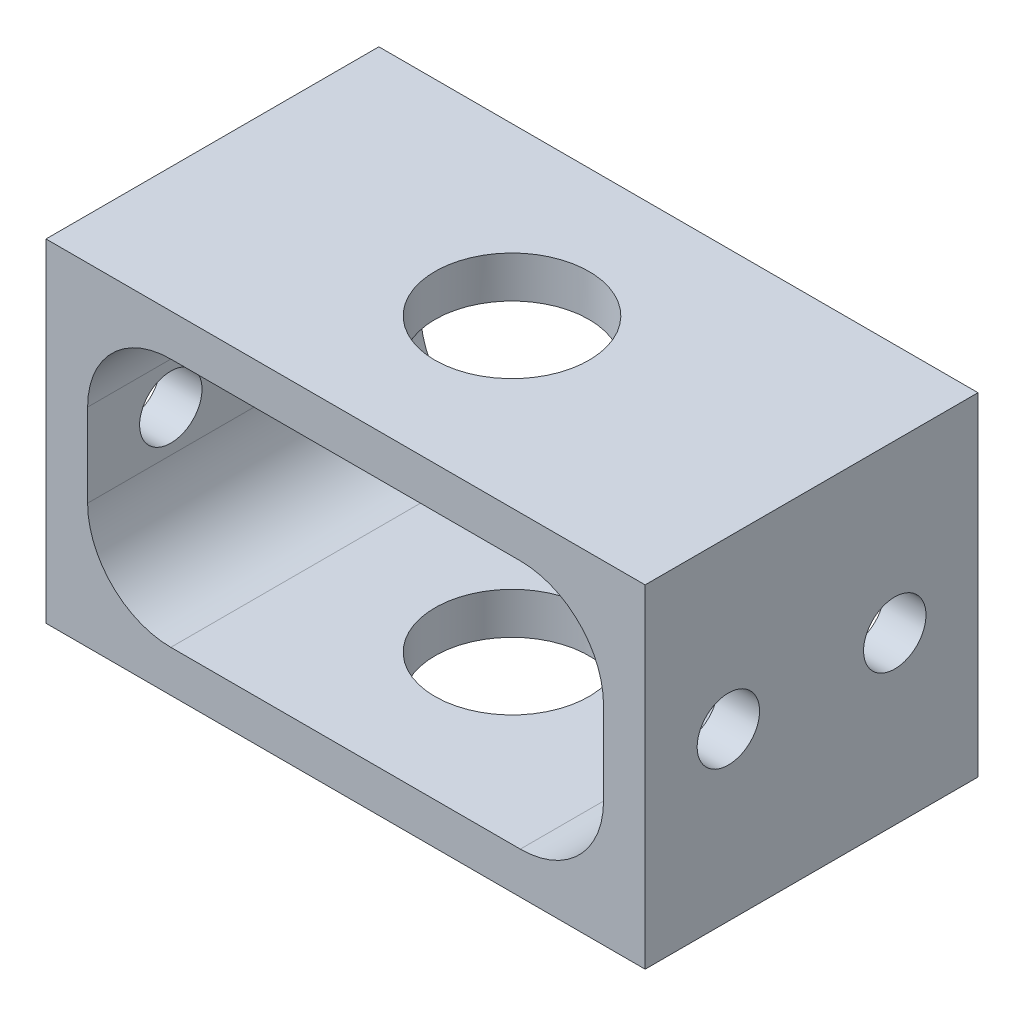
ISO-10303-21;
HEADER;
FILE_DESCRIPTION(('STEP AP214'),'2;1');
FILE_NAME('part.step','',(''),(''),'','','');
FILE_SCHEMA(('AUTOMOTIVE_DESIGN { 1 0 10303 214 1 1 1 1 }'));
ENDSEC;
DATA;
#1=APPLICATION_CONTEXT('core data for automotive mechanical design processes');
#2=APPLICATION_PROTOCOL_DEFINITION('international standard','automotive_design',2000,#1);
#3=PRODUCT_CONTEXT('',#1,'mechanical');
#4=PRODUCT('Part','Part','',(#3));
#5=PRODUCT_RELATED_PRODUCT_CATEGORY('part','',(#4));
#6=PRODUCT_DEFINITION_FORMATION('','',#4);
#7=PRODUCT_DEFINITION_CONTEXT('part definition',#1,'design');
#8=PRODUCT_DEFINITION('design','',#6,#7);
#9=PRODUCT_DEFINITION_SHAPE('','',#8);
#10=(LENGTH_UNIT() NAMED_UNIT(*) SI_UNIT(.MILLI.,.METRE.));
#11=(NAMED_UNIT(*) PLANE_ANGLE_UNIT() SI_UNIT($,.RADIAN.));
#12=(NAMED_UNIT(*) SI_UNIT($,.STERADIAN.) SOLID_ANGLE_UNIT());
#13=UNCERTAINTY_MEASURE_WITH_UNIT(LENGTH_MEASURE(1.E-05),#10,'distance_accuracy_value','');
#14=(GEOMETRIC_REPRESENTATION_CONTEXT(3) GLOBAL_UNCERTAINTY_ASSIGNED_CONTEXT((#13)) GLOBAL_UNIT_ASSIGNED_CONTEXT((#10,
#11,#12)) REPRESENTATION_CONTEXT('',''));
#15=CARTESIAN_POINT('',(0.,0.,0.));
#16=DIRECTION('',(0.,0.,1.));
#17=DIRECTION('',(1.,0.,0.));
#18=AXIS2_PLACEMENT_3D('',#15,#16,#17);
#19=CARTESIAN_POINT('',(0.,0.,16.));
#20=DIRECTION('',(0.,0.,-1.));
#21=DIRECTION('',(-1.,0.,0.));
#22=AXIS2_PLACEMENT_3D('',#19,#20,#21);
#23=PLANE('',#22);
#24=DIRECTION('',(-1.,0.,0.));
#25=VECTOR('',#24,1.);
#26=CARTESIAN_POINT('',(-14.4,8.,16.));
#27=LINE('',#26,#25);
#28=CARTESIAN_POINT('',(14.4,8.,16.));
#29=VERTEX_POINT('',#28);
#30=CARTESIAN_POINT('',(-14.4,8.,16.));
#31=VERTEX_POINT('',#30);
#32=EDGE_CURVE('E144',#29,#31,#27,.T.);
#33=ORIENTED_EDGE('',*,*,#32,.T.);
#34=DIRECTION('',(0.,-1.,0.));
#35=VECTOR('',#34,1.);
#36=CARTESIAN_POINT('',(-14.4,8.,16.));
#37=LINE('',#36,#35);
#38=CARTESIAN_POINT('',(-14.4,-8.,16.));
#39=VERTEX_POINT('',#38);
#40=EDGE_CURVE('E132',#31,#39,#37,.T.);
#41=ORIENTED_EDGE('',*,*,#40,.T.);
#42=DIRECTION('',(1.,0.,0.));
#43=VECTOR('',#42,1.);
#44=CARTESIAN_POINT('',(-14.4,-8.,16.));
#45=LINE('',#44,#43);
#46=CARTESIAN_POINT('',(14.4,-8.,16.));
#47=VERTEX_POINT('',#46);
#48=EDGE_CURVE('E143',#39,#47,#45,.T.);
#49=ORIENTED_EDGE('',*,*,#48,.T.);
#50=DIRECTION('',(0.,1.,0.));
#51=VECTOR('',#50,1.);
#52=CARTESIAN_POINT('',(14.4,8.,16.));
#53=LINE('',#52,#51);
#54=EDGE_CURVE('E148',#47,#29,#53,.T.);
#55=ORIENTED_EDGE('',*,*,#54,.T.);
#56=EDGE_LOOP('',(#33,#41,#49,#55));
#57=FACE_BOUND('',#56,.T.);
#58=DIRECTION('',(0.,1.,0.));
#59=VECTOR('',#58,1.);
#60=CARTESIAN_POINT('',(12.4,6.,16.));
#61=LINE('',#60,#59);
#62=CARTESIAN_POINT('',(12.4,-2.,16.));
#63=VERTEX_POINT('',#62);
#64=CARTESIAN_POINT('',(12.4,2.,16.));
#65=VERTEX_POINT('',#64);
#66=EDGE_CURVE('E238',#63,#65,#61,.T.);
#67=ORIENTED_EDGE('',*,*,#66,.F.);
#68=CARTESIAN_POINT('',(8.4,-2.,16.));
#69=DIRECTION('',(0.,0.,-1.));
#70=DIRECTION('',(-1.,0.,0.));
#71=AXIS2_PLACEMENT_3D('',#68,#69,#70);
#72=CIRCLE('',#71,4.);
#73=CARTESIAN_POINT('',(8.4,-6.,16.));
#74=VERTEX_POINT('',#73);
#75=EDGE_CURVE('E57',#63,#74,#72,.T.);
#76=ORIENTED_EDGE('',*,*,#75,.T.);
#77=DIRECTION('',(1.,0.,0.));
#78=VECTOR('',#77,1.);
#79=CARTESIAN_POINT('',(-12.4,-6.,16.));
#80=LINE('',#79,#78);
#81=CARTESIAN_POINT('',(-8.4,-6.,16.));
#82=VERTEX_POINT('',#81);
#83=EDGE_CURVE('E245',#82,#74,#80,.T.);
#84=ORIENTED_EDGE('',*,*,#83,.F.);
#85=CARTESIAN_POINT('',(-8.4,-2.,16.));
#86=DIRECTION('',(0.,0.,-1.));
#87=DIRECTION('',(-1.,0.,0.));
#88=AXIS2_PLACEMENT_3D('',#85,#86,#87);
#89=CIRCLE('',#88,4.);
#90=CARTESIAN_POINT('',(-12.4,-2.,16.));
#91=VERTEX_POINT('',#90);
#92=EDGE_CURVE('E11',#82,#91,#89,.T.);
#93=ORIENTED_EDGE('',*,*,#92,.T.);
#94=DIRECTION('',(0.,-1.,0.));
#95=VECTOR('',#94,1.);
#96=CARTESIAN_POINT('',(-12.4,6.,16.));
#97=LINE('',#96,#95);
#98=CARTESIAN_POINT('',(-12.4,2.,16.));
#99=VERTEX_POINT('',#98);
#100=EDGE_CURVE('E243',#99,#91,#97,.T.);
#101=ORIENTED_EDGE('',*,*,#100,.F.);
#102=CARTESIAN_POINT('',(-8.4,2.,16.));
#103=DIRECTION('',(0.,0.,-1.));
#104=DIRECTION('',(-1.,0.,0.));
#105=AXIS2_PLACEMENT_3D('',#102,#103,#104);
#106=CIRCLE('',#105,4.);
#107=CARTESIAN_POINT('',(-8.4,6.,16.));
#108=VERTEX_POINT('',#107);
#109=EDGE_CURVE('E218',#99,#108,#106,.T.);
#110=ORIENTED_EDGE('',*,*,#109,.T.);
#111=DIRECTION('',(-1.,0.,0.));
#112=VECTOR('',#111,1.);
#113=CARTESIAN_POINT('',(-12.4,6.,16.));
#114=LINE('',#113,#112);
#115=CARTESIAN_POINT('',(8.39999999999999,6.,16.));
#116=VERTEX_POINT('',#115);
#117=EDGE_CURVE('E250',#116,#108,#114,.T.);
#118=ORIENTED_EDGE('',*,*,#117,.F.);
#119=CARTESIAN_POINT('',(8.4,2.,16.));
#120=DIRECTION('',(0.,0.,-1.));
#121=DIRECTION('',(-1.,0.,0.));
#122=AXIS2_PLACEMENT_3D('',#119,#120,#121);
#123=CIRCLE('',#122,4.);
#124=EDGE_CURVE('E212',#116,#65,#123,.T.);
#125=ORIENTED_EDGE('',*,*,#124,.T.);
#126=EDGE_LOOP('',(#67,#76,#84,#93,#101,#110,#118,#125));
#127=FACE_BOUND('',#126,.T.);
#128=ADVANCED_FACE('F41',(#57,#127),#23,.F.);
#129=CARTESIAN_POINT('',(0.,0.,0.));
#130=DIRECTION('',(0.,0.,-1.));
#131=DIRECTION('',(-1.,0.,0.));
#132=AXIS2_PLACEMENT_3D('',#129,#130,#131);
#133=PLANE('',#132);
#134=DIRECTION('',(-1.,0.,0.));
#135=VECTOR('',#134,1.);
#136=CARTESIAN_POINT('',(-14.4,8.,0.));
#137=LINE('',#136,#135);
#138=CARTESIAN_POINT('',(14.4,8.,0.));
#139=VERTEX_POINT('',#138);
#140=CARTESIAN_POINT('',(-14.4,8.,0.));
#141=VERTEX_POINT('',#140);
#142=EDGE_CURVE('E157',#139,#141,#137,.T.);
#143=ORIENTED_EDGE('',*,*,#142,.F.);
#144=DIRECTION('',(0.,1.,0.));
#145=VECTOR('',#144,1.);
#146=CARTESIAN_POINT('',(14.4,8.,0.));
#147=LINE('',#146,#145);
#148=CARTESIAN_POINT('',(14.4,-8.,0.));
#149=VERTEX_POINT('',#148);
#150=EDGE_CURVE('E153',#149,#139,#147,.T.);
#151=ORIENTED_EDGE('',*,*,#150,.F.);
#152=DIRECTION('',(1.,0.,0.));
#153=VECTOR('',#152,1.);
#154=CARTESIAN_POINT('',(-14.4,-8.,0.));
#155=LINE('',#154,#153);
#156=CARTESIAN_POINT('',(-14.4,-8.,0.));
#157=VERTEX_POINT('',#156);
#158=EDGE_CURVE('E279',#157,#149,#155,.T.);
#159=ORIENTED_EDGE('',*,*,#158,.F.);
#160=DIRECTION('',(0.,-1.,0.));
#161=VECTOR('',#160,1.);
#162=CARTESIAN_POINT('',(-14.4,8.,0.));
#163=LINE('',#162,#161);
#164=EDGE_CURVE('E276',#141,#157,#163,.T.);
#165=ORIENTED_EDGE('',*,*,#164,.F.);
#166=EDGE_LOOP('',(#143,#151,#159,#165));
#167=FACE_BOUND('',#166,.T.);
#168=DIRECTION('',(0.,-1.,0.));
#169=VECTOR('',#168,1.);
#170=CARTESIAN_POINT('',(-12.4,6.,0.));
#171=LINE('',#170,#169);
#172=CARTESIAN_POINT('',(-12.4,2.,0.));
#173=VERTEX_POINT('',#172);
#174=CARTESIAN_POINT('',(-12.4,-2.,0.));
#175=VERTEX_POINT('',#174);
#176=EDGE_CURVE('E232',#173,#175,#171,.T.);
#177=ORIENTED_EDGE('',*,*,#176,.T.);
#178=CARTESIAN_POINT('',(-8.4,-2.,0.));
#179=DIRECTION('',(0.,0.,-1.));
#180=DIRECTION('',(-1.,0.,0.));
#181=AXIS2_PLACEMENT_3D('',#178,#179,#180);
#182=CIRCLE('',#181,4.);
#183=CARTESIAN_POINT('',(-8.4,-6.,0.));
#184=VERTEX_POINT('',#183);
#185=EDGE_CURVE('E50',#175,#184,#182,.F.);
#186=ORIENTED_EDGE('',*,*,#185,.T.);
#187=DIRECTION('',(1.,0.,0.));
#188=VECTOR('',#187,1.);
#189=CARTESIAN_POINT('',(-12.4,-6.,0.));
#190=LINE('',#189,#188);
#191=CARTESIAN_POINT('',(8.4,-6.,0.));
#192=VERTEX_POINT('',#191);
#193=EDGE_CURVE('E230',#184,#192,#190,.T.);
#194=ORIENTED_EDGE('',*,*,#193,.T.);
#195=CARTESIAN_POINT('',(8.4,-2.,0.));
#196=DIRECTION('',(0.,0.,-1.));
#197=DIRECTION('',(-1.,0.,0.));
#198=AXIS2_PLACEMENT_3D('',#195,#196,#197);
#199=CIRCLE('',#198,4.);
#200=CARTESIAN_POINT('',(12.4,-2.,0.));
#201=VERTEX_POINT('',#200);
#202=EDGE_CURVE('E221',#192,#201,#199,.F.);
#203=ORIENTED_EDGE('',*,*,#202,.T.);
#204=DIRECTION('',(0.,1.,0.));
#205=VECTOR('',#204,1.);
#206=CARTESIAN_POINT('',(12.4,6.,0.));
#207=LINE('',#206,#205);
#208=CARTESIAN_POINT('',(12.4,2.,0.));
#209=VERTEX_POINT('',#208);
#210=EDGE_CURVE('E259',#201,#209,#207,.T.);
#211=ORIENTED_EDGE('',*,*,#210,.T.);
#212=CARTESIAN_POINT('',(8.4,2.,0.));
#213=DIRECTION('',(0.,0.,-1.));
#214=DIRECTION('',(-1.,0.,0.));
#215=AXIS2_PLACEMENT_3D('',#212,#213,#214);
#216=CIRCLE('',#215,4.);
#217=CARTESIAN_POINT('',(8.39999999999999,6.,0.));
#218=VERTEX_POINT('',#217);
#219=EDGE_CURVE('E209',#209,#218,#216,.F.);
#220=ORIENTED_EDGE('',*,*,#219,.T.);
#221=DIRECTION('',(-1.,0.,0.));
#222=VECTOR('',#221,1.);
#223=CARTESIAN_POINT('',(-12.4,6.,0.));
#224=LINE('',#223,#222);
#225=CARTESIAN_POINT('',(-8.4,6.,0.));
#226=VERTEX_POINT('',#225);
#227=EDGE_CURVE('E263',#218,#226,#224,.T.);
#228=ORIENTED_EDGE('',*,*,#227,.T.);
#229=CARTESIAN_POINT('',(-8.4,2.,0.));
#230=DIRECTION('',(0.,0.,-1.));
#231=DIRECTION('',(-1.,0.,0.));
#232=AXIS2_PLACEMENT_3D('',#229,#230,#231);
#233=CIRCLE('',#232,4.);
#234=EDGE_CURVE('E215',#226,#173,#233,.F.);
#235=ORIENTED_EDGE('',*,*,#234,.T.);
#236=EDGE_LOOP('',(#177,#186,#194,#203,#211,#220,#228,#235));
#237=FACE_BOUND('',#236,.T.);
#238=ADVANCED_FACE('F229',(#167,#237),#133,.T.);
#239=CARTESIAN_POINT('',(-14.4,8.,16.));
#240=DIRECTION('',(0.,-1.,0.));
#241=DIRECTION('',(0.,0.,-1.));
#242=AXIS2_PLACEMENT_3D('',#239,#240,#241);
#243=PLANE('',#242);
#244=CARTESIAN_POINT('',(0.,8.,8.));
#245=DIRECTION('',(0.,1.,0.));
#246=DIRECTION('',(0.,0.,1.));
#247=AXIS2_PLACEMENT_3D('',#244,#245,#246);
#248=CIRCLE('',#247,3.7);
#249=CARTESIAN_POINT('',(0.,8.,11.7));
#250=VERTEX_POINT('',#249);
#251=EDGE_CURVE('E353',#250,#250,#248,.T.);
#252=ORIENTED_EDGE('',*,*,#251,.F.);
#253=EDGE_LOOP('',(#252));
#254=FACE_BOUND('',#253,.T.);
#255=ORIENTED_EDGE('',*,*,#142,.T.);
#256=DIRECTION('',(0.,0.,-1.));
#257=VECTOR('',#256,1.);
#258=CARTESIAN_POINT('',(-14.4,8.,16.));
#259=LINE('',#258,#257);
#260=EDGE_CURVE('E136',#31,#141,#259,.T.);
#261=ORIENTED_EDGE('',*,*,#260,.F.);
#262=ORIENTED_EDGE('',*,*,#32,.F.);
#263=DIRECTION('',(0.,0.,-1.));
#264=VECTOR('',#263,1.);
#265=CARTESIAN_POINT('',(14.4,8.,16.));
#266=LINE('',#265,#264);
#267=EDGE_CURVE('E273',#29,#139,#266,.T.);
#268=ORIENTED_EDGE('',*,*,#267,.T.);
#269=EDGE_LOOP('',(#255,#261,#262,#268));
#270=FACE_BOUND('',#269,.T.);
#271=ADVANCED_FACE('F155',(#254,#270),#243,.F.);
#272=CARTESIAN_POINT('',(-14.4,8.,16.));
#273=DIRECTION('',(1.,0.,0.));
#274=DIRECTION('',(0.,1.,0.));
#275=AXIS2_PLACEMENT_3D('',#272,#273,#274);
#276=PLANE('',#275);
#277=CARTESIAN_POINT('',(-14.4,0.,12.));
#278=DIRECTION('',(1.,0.,0.));
#279=DIRECTION('',(0.,1.,0.));
#280=AXIS2_PLACEMENT_3D('',#277,#278,#279);
#281=CIRCLE('',#280,1.5);
#282=CARTESIAN_POINT('',(-14.4,1.5,12.));
#283=VERTEX_POINT('',#282);
#284=EDGE_CURVE('E174',#283,#283,#281,.F.);
#285=ORIENTED_EDGE('',*,*,#284,.F.);
#286=EDGE_LOOP('',(#285));
#287=FACE_BOUND('',#286,.T.);
#288=CARTESIAN_POINT('',(-14.4,0.,4.));
#289=DIRECTION('',(1.,0.,0.));
#290=DIRECTION('',(0.,1.,0.));
#291=AXIS2_PLACEMENT_3D('',#288,#289,#290);
#292=CIRCLE('',#291,1.5);
#293=CARTESIAN_POINT('',(-14.4,1.5,4.));
#294=VERTEX_POINT('',#293);
#295=EDGE_CURVE('E367',#294,#294,#292,.F.);
#296=ORIENTED_EDGE('',*,*,#295,.F.);
#297=EDGE_LOOP('',(#296));
#298=FACE_BOUND('',#297,.T.);
#299=ORIENTED_EDGE('',*,*,#164,.T.);
#300=DIRECTION('',(0.,0.,-1.));
#301=VECTOR('',#300,1.);
#302=CARTESIAN_POINT('',(-14.4,-8.,16.));
#303=LINE('',#302,#301);
#304=EDGE_CURVE('E139',#39,#157,#303,.T.);
#305=ORIENTED_EDGE('',*,*,#304,.F.);
#306=ORIENTED_EDGE('',*,*,#40,.F.);
#307=ORIENTED_EDGE('',*,*,#260,.T.);
#308=EDGE_LOOP('',(#299,#305,#306,#307));
#309=FACE_BOUND('',#308,.T.);
#310=ADVANCED_FACE('F134',(#287,#298,#309),#276,.F.);
#311=CARTESIAN_POINT('',(-14.4,-8.,16.));
#312=DIRECTION('',(0.,1.,0.));
#313=DIRECTION('',(0.,0.,1.));
#314=AXIS2_PLACEMENT_3D('',#311,#312,#313);
#315=PLANE('',#314);
#316=CARTESIAN_POINT('',(0.,-8.,8.));
#317=DIRECTION('',(0.,1.,0.));
#318=DIRECTION('',(0.,0.,1.));
#319=AXIS2_PLACEMENT_3D('',#316,#317,#318);
#320=CIRCLE('',#319,3.7);
#321=CARTESIAN_POINT('',(0.,-8.,11.7));
#322=VERTEX_POINT('',#321);
#323=EDGE_CURVE('E184',#322,#322,#320,.F.);
#324=ORIENTED_EDGE('',*,*,#323,.F.);
#325=EDGE_LOOP('',(#324));
#326=FACE_BOUND('',#325,.T.);
#327=ORIENTED_EDGE('',*,*,#158,.T.);
#328=DIRECTION('',(0.,0.,-1.));
#329=VECTOR('',#328,1.);
#330=CARTESIAN_POINT('',(14.4,-8.,16.));
#331=LINE('',#330,#329);
#332=EDGE_CURVE('E165',#47,#149,#331,.T.);
#333=ORIENTED_EDGE('',*,*,#332,.F.);
#334=ORIENTED_EDGE('',*,*,#48,.F.);
#335=ORIENTED_EDGE('',*,*,#304,.T.);
#336=EDGE_LOOP('',(#327,#333,#334,#335));
#337=FACE_BOUND('',#336,.T.);
#338=ADVANCED_FACE('F294',(#326,#337),#315,.F.);
#339=CARTESIAN_POINT('',(14.4,8.,16.));
#340=DIRECTION('',(-1.,0.,0.));
#341=DIRECTION('',(0.,-1.,0.));
#342=AXIS2_PLACEMENT_3D('',#339,#340,#341);
#343=PLANE('',#342);
#344=CARTESIAN_POINT('',(14.4,0.,12.));
#345=DIRECTION('',(1.,0.,0.));
#346=DIRECTION('',(0.,1.,0.));
#347=AXIS2_PLACEMENT_3D('',#344,#345,#346);
#348=CIRCLE('',#347,1.5);
#349=CARTESIAN_POINT('',(14.4,1.5,12.));
#350=VERTEX_POINT('',#349);
#351=EDGE_CURVE('E363',#350,#350,#348,.T.);
#352=ORIENTED_EDGE('',*,*,#351,.F.);
#353=EDGE_LOOP('',(#352));
#354=FACE_BOUND('',#353,.T.);
#355=CARTESIAN_POINT('',(14.4,0.,4.));
#356=DIRECTION('',(1.,0.,0.));
#357=DIRECTION('',(0.,1.,0.));
#358=AXIS2_PLACEMENT_3D('',#355,#356,#357);
#359=CIRCLE('',#358,1.5);
#360=CARTESIAN_POINT('',(14.4,1.5,4.));
#361=VERTEX_POINT('',#360);
#362=EDGE_CURVE('E362',#361,#361,#359,.T.);
#363=ORIENTED_EDGE('',*,*,#362,.F.);
#364=EDGE_LOOP('',(#363));
#365=FACE_BOUND('',#364,.T.);
#366=ORIENTED_EDGE('',*,*,#150,.T.);
#367=ORIENTED_EDGE('',*,*,#267,.F.);
#368=ORIENTED_EDGE('',*,*,#54,.F.);
#369=ORIENTED_EDGE('',*,*,#332,.T.);
#370=EDGE_LOOP('',(#366,#367,#368,#369));
#371=FACE_BOUND('',#370,.T.);
#372=ADVANCED_FACE('F290',(#354,#365,#371),#343,.F.);
#373=CARTESIAN_POINT('',(12.4,6.,16.));
#374=DIRECTION('',(-1.,0.,0.));
#375=DIRECTION('',(0.,0.,1.));
#376=AXIS2_PLACEMENT_3D('',#373,#374,#375);
#377=PLANE('',#376);
#378=CARTESIAN_POINT('',(12.4,0.,12.));
#379=DIRECTION('',(-1.,0.,0.));
#380=DIRECTION('',(0.,0.,1.));
#381=AXIS2_PLACEMENT_3D('',#378,#379,#380);
#382=CIRCLE('',#381,1.5);
#383=CARTESIAN_POINT('',(12.4,0.,13.5));
#384=VERTEX_POINT('',#383);
#385=EDGE_CURVE('E179',#384,#384,#382,.T.);
#386=ORIENTED_EDGE('',*,*,#385,.F.);
#387=EDGE_LOOP('',(#386));
#388=FACE_BOUND('',#387,.T.);
#389=CARTESIAN_POINT('',(12.4,0.,4.));
#390=DIRECTION('',(-1.,0.,0.));
#391=DIRECTION('',(0.,0.,1.));
#392=AXIS2_PLACEMENT_3D('',#389,#390,#391);
#393=CIRCLE('',#392,1.5);
#394=CARTESIAN_POINT('',(12.4,0.,5.5));
#395=VERTEX_POINT('',#394);
#396=EDGE_CURVE('E173',#395,#395,#393,.T.);
#397=ORIENTED_EDGE('',*,*,#396,.F.);
#398=EDGE_LOOP('',(#397));
#399=FACE_BOUND('',#398,.T.);
#400=ORIENTED_EDGE('',*,*,#66,.T.);
#401=DIRECTION('',(0.,0.,-1.));
#402=VECTOR('',#401,1.);
#403=CARTESIAN_POINT('',(12.4,2.,0.));
#404=LINE('',#403,#402);
#405=EDGE_CURVE('E163',#65,#209,#404,.T.);
#406=ORIENTED_EDGE('',*,*,#405,.T.);
#407=ORIENTED_EDGE('',*,*,#210,.F.);
#408=DIRECTION('',(0.,0.,-1.));
#409=VECTOR('',#408,1.);
#410=CARTESIAN_POINT('',(12.4,-2.,16.));
#411=LINE('',#410,#409);
#412=EDGE_CURVE('E159',#201,#63,#411,.F.);
#413=ORIENTED_EDGE('',*,*,#412,.T.);
#414=EDGE_LOOP('',(#400,#406,#407,#413));
#415=FACE_BOUND('',#414,.T.);
#416=ADVANCED_FACE('F302',(#388,#399,#415),#377,.T.);
#417=CARTESIAN_POINT('',(-12.4,6.,16.));
#418=DIRECTION('',(0.,-1.,0.));
#419=DIRECTION('',(0.,0.,-1.));
#420=AXIS2_PLACEMENT_3D('',#417,#418,#419);
#421=PLANE('',#420);
#422=CARTESIAN_POINT('',(0.,6.,8.));
#423=DIRECTION('',(0.,-1.,0.));
#424=DIRECTION('',(0.,0.,-1.));
#425=AXIS2_PLACEMENT_3D('',#422,#423,#424);
#426=CIRCLE('',#425,3.7);
#427=CARTESIAN_POINT('',(0.,6.,4.3));
#428=VERTEX_POINT('',#427);
#429=EDGE_CURVE('E183',#428,#428,#426,.T.);
#430=ORIENTED_EDGE('',*,*,#429,.F.);
#431=EDGE_LOOP('',(#430));
#432=FACE_BOUND('',#431,.T.);
#433=ORIENTED_EDGE('',*,*,#227,.F.);
#434=DIRECTION('',(0.,0.,-1.));
#435=VECTOR('',#434,1.);
#436=CARTESIAN_POINT('',(8.4,6.,16.));
#437=LINE('',#436,#435);
#438=EDGE_CURVE('E193',#218,#116,#437,.F.);
#439=ORIENTED_EDGE('',*,*,#438,.T.);
#440=ORIENTED_EDGE('',*,*,#117,.T.);
#441=DIRECTION('',(0.,0.,-1.));
#442=VECTOR('',#441,1.);
#443=CARTESIAN_POINT('',(-8.4,6.,0.));
#444=LINE('',#443,#442);
#445=EDGE_CURVE('E189',#108,#226,#444,.T.);
#446=ORIENTED_EDGE('',*,*,#445,.T.);
#447=EDGE_LOOP('',(#433,#439,#440,#446));
#448=FACE_BOUND('',#447,.T.);
#449=ADVANCED_FACE('F317',(#432,#448),#421,.T.);
#450=CARTESIAN_POINT('',(-12.4,6.,16.));
#451=DIRECTION('',(1.,0.,0.));
#452=DIRECTION('',(0.,1.,0.));
#453=AXIS2_PLACEMENT_3D('',#450,#451,#452);
#454=PLANE('',#453);
#455=CARTESIAN_POINT('',(-12.4,0.,12.));
#456=DIRECTION('',(1.,0.,0.));
#457=DIRECTION('',(0.,1.,0.));
#458=AXIS2_PLACEMENT_3D('',#455,#456,#457);
#459=CIRCLE('',#458,1.5);
#460=CARTESIAN_POINT('',(-12.4,1.5,12.));
#461=VERTEX_POINT('',#460);
#462=EDGE_CURVE('E175',#461,#461,#459,.T.);
#463=ORIENTED_EDGE('',*,*,#462,.F.);
#464=EDGE_LOOP('',(#463));
#465=FACE_BOUND('',#464,.T.);
#466=CARTESIAN_POINT('',(-12.4,0.,4.));
#467=DIRECTION('',(1.,0.,0.));
#468=DIRECTION('',(0.,1.,0.));
#469=AXIS2_PLACEMENT_3D('',#466,#467,#468);
#470=CIRCLE('',#469,1.5);
#471=CARTESIAN_POINT('',(-12.4,1.5,4.));
#472=VERTEX_POINT('',#471);
#473=EDGE_CURVE('E169',#472,#472,#470,.T.);
#474=ORIENTED_EDGE('',*,*,#473,.F.);
#475=EDGE_LOOP('',(#474));
#476=FACE_BOUND('',#475,.T.);
#477=ORIENTED_EDGE('',*,*,#176,.F.);
#478=DIRECTION('',(0.,0.,-1.));
#479=VECTOR('',#478,1.);
#480=CARTESIAN_POINT('',(-12.4,2.,16.));
#481=LINE('',#480,#479);
#482=EDGE_CURVE('E200',#173,#99,#481,.F.);
#483=ORIENTED_EDGE('',*,*,#482,.T.);
#484=ORIENTED_EDGE('',*,*,#100,.T.);
#485=DIRECTION('',(0.,0.,-1.));
#486=VECTOR('',#485,1.);
#487=CARTESIAN_POINT('',(-12.4,-2.,0.));
#488=LINE('',#487,#486);
#489=EDGE_CURVE('E196',#91,#175,#488,.T.);
#490=ORIENTED_EDGE('',*,*,#489,.T.);
#491=EDGE_LOOP('',(#477,#483,#484,#490));
#492=FACE_BOUND('',#491,.T.);
#493=ADVANCED_FACE('F247',(#465,#476,#492),#454,.T.);
#494=CARTESIAN_POINT('',(-12.4,-6.,16.));
#495=DIRECTION('',(0.,1.,0.));
#496=DIRECTION('',(0.,0.,1.));
#497=AXIS2_PLACEMENT_3D('',#494,#495,#496);
#498=PLANE('',#497);
#499=CARTESIAN_POINT('',(0.,-6.,8.));
#500=DIRECTION('',(0.,1.,0.));
#501=DIRECTION('',(0.,0.,1.));
#502=AXIS2_PLACEMENT_3D('',#499,#500,#501);
#503=CIRCLE('',#502,3.7);
#504=CARTESIAN_POINT('',(0.,-6.,11.7));
#505=VERTEX_POINT('',#504);
#506=EDGE_CURVE('E180',#505,#505,#503,.T.);
#507=ORIENTED_EDGE('',*,*,#506,.F.);
#508=EDGE_LOOP('',(#507));
#509=FACE_BOUND('',#508,.T.);
#510=ORIENTED_EDGE('',*,*,#83,.T.);
#511=DIRECTION('',(0.,0.,-1.));
#512=VECTOR('',#511,1.);
#513=CARTESIAN_POINT('',(8.4,-6.,0.));
#514=LINE('',#513,#512);
#515=EDGE_CURVE('E205',#74,#192,#514,.T.);
#516=ORIENTED_EDGE('',*,*,#515,.T.);
#517=ORIENTED_EDGE('',*,*,#193,.F.);
#518=DIRECTION('',(0.,0.,-1.));
#519=VECTOR('',#518,1.);
#520=CARTESIAN_POINT('',(-8.4,-6.,16.));
#521=LINE('',#520,#519);
#522=EDGE_CURVE('E64',#184,#82,#521,.F.);
#523=ORIENTED_EDGE('',*,*,#522,.T.);
#524=EDGE_LOOP('',(#510,#516,#517,#523));
#525=FACE_BOUND('',#524,.T.);
#526=ADVANCED_FACE('F235',(#509,#525),#498,.T.);
#527=CARTESIAN_POINT('',(-18.6426406871193,0.,4.));
#528=DIRECTION('',(1.,0.,0.));
#529=DIRECTION('',(0.,1.,0.));
#530=AXIS2_PLACEMENT_3D('',#527,#528,#529);
#531=CYLINDRICAL_SURFACE('',#530,1.5);
#532=ORIENTED_EDGE('',*,*,#473,.T.);
#533=EDGE_LOOP('',(#532));
#534=FACE_BOUND('',#533,.T.);
#535=ORIENTED_EDGE('',*,*,#295,.T.);
#536=EDGE_LOOP('',(#535));
#537=FACE_BOUND('',#536,.T.);
#538=ADVANCED_FACE('F327',(#534,#537),#531,.F.);
#539=CARTESIAN_POINT('',(-18.6426406871193,0.,12.));
#540=DIRECTION('',(1.,0.,0.));
#541=DIRECTION('',(0.,1.,0.));
#542=AXIS2_PLACEMENT_3D('',#539,#540,#541);
#543=CYLINDRICAL_SURFACE('',#542,1.5);
#544=ORIENTED_EDGE('',*,*,#462,.T.);
#545=EDGE_LOOP('',(#544));
#546=FACE_BOUND('',#545,.T.);
#547=ORIENTED_EDGE('',*,*,#284,.T.);
#548=EDGE_LOOP('',(#547));
#549=FACE_BOUND('',#548,.T.);
#550=ADVANCED_FACE('F331',(#546,#549),#543,.F.);
#551=ORIENTED_EDGE('',*,*,#396,.T.);
#552=EDGE_LOOP('',(#551));
#553=FACE_BOUND('',#552,.T.);
#554=ORIENTED_EDGE('',*,*,#362,.T.);
#555=EDGE_LOOP('',(#554));
#556=FACE_BOUND('',#555,.T.);
#557=ADVANCED_FACE('F333',(#553,#556),#531,.F.);
#558=ORIENTED_EDGE('',*,*,#385,.T.);
#559=EDGE_LOOP('',(#558));
#560=FACE_BOUND('',#559,.T.);
#561=ORIENTED_EDGE('',*,*,#351,.T.);
#562=EDGE_LOOP('',(#561));
#563=FACE_BOUND('',#562,.T.);
#564=ADVANCED_FACE('F337',(#560,#563),#543,.F.);
#565=CARTESIAN_POINT('',(0.,-18.4651803615609,8.));
#566=DIRECTION('',(0.,1.,0.));
#567=DIRECTION('',(0.,0.,1.));
#568=AXIS2_PLACEMENT_3D('',#565,#566,#567);
#569=CYLINDRICAL_SURFACE('',#568,3.7);
#570=ORIENTED_EDGE('',*,*,#506,.T.);
#571=EDGE_LOOP('',(#570));
#572=FACE_BOUND('',#571,.T.);
#573=ORIENTED_EDGE('',*,*,#323,.T.);
#574=EDGE_LOOP('',(#573));
#575=FACE_BOUND('',#574,.T.);
#576=ADVANCED_FACE('F338',(#572,#575),#569,.F.);
#577=ORIENTED_EDGE('',*,*,#429,.T.);
#578=EDGE_LOOP('',(#577));
#579=FACE_BOUND('',#578,.T.);
#580=ORIENTED_EDGE('',*,*,#251,.T.);
#581=EDGE_LOOP('',(#580));
#582=FACE_BOUND('',#581,.T.);
#583=ADVANCED_FACE('F340',(#579,#582),#569,.F.);
#584=CARTESIAN_POINT('',(8.4,2.,16.));
#585=DIRECTION('',(0.,0.,1.));
#586=DIRECTION('',(1.,0.,0.));
#587=AXIS2_PLACEMENT_3D('',#584,#585,#586);
#588=CYLINDRICAL_SURFACE('',#587,4.);
#589=ORIENTED_EDGE('',*,*,#124,.F.);
#590=ORIENTED_EDGE('',*,*,#438,.F.);
#591=ORIENTED_EDGE('',*,*,#219,.F.);
#592=ORIENTED_EDGE('',*,*,#405,.F.);
#593=EDGE_LOOP('',(#589,#590,#591,#592));
#594=FACE_BOUND('',#593,.T.);
#595=ADVANCED_FACE('F346',(#594),#588,.F.);
#596=CARTESIAN_POINT('',(-8.4,2.,16.));
#597=DIRECTION('',(0.,0.,1.));
#598=DIRECTION('',(1.,0.,0.));
#599=AXIS2_PLACEMENT_3D('',#596,#597,#598);
#600=CYLINDRICAL_SURFACE('',#599,4.);
#601=ORIENTED_EDGE('',*,*,#109,.F.);
#602=ORIENTED_EDGE('',*,*,#482,.F.);
#603=ORIENTED_EDGE('',*,*,#234,.F.);
#604=ORIENTED_EDGE('',*,*,#445,.F.);
#605=EDGE_LOOP('',(#601,#602,#603,#604));
#606=FACE_BOUND('',#605,.T.);
#607=ADVANCED_FACE('F396',(#606),#600,.F.);
#608=CARTESIAN_POINT('',(8.4,-2.,16.));
#609=DIRECTION('',(0.,0.,1.));
#610=DIRECTION('',(1.,0.,0.));
#611=AXIS2_PLACEMENT_3D('',#608,#609,#610);
#612=CYLINDRICAL_SURFACE('',#611,4.);
#613=ORIENTED_EDGE('',*,*,#75,.F.);
#614=ORIENTED_EDGE('',*,*,#412,.F.);
#615=ORIENTED_EDGE('',*,*,#202,.F.);
#616=ORIENTED_EDGE('',*,*,#515,.F.);
#617=EDGE_LOOP('',(#613,#614,#615,#616));
#618=FACE_BOUND('',#617,.T.);
#619=ADVANCED_FACE('F398',(#618),#612,.F.);
#620=CARTESIAN_POINT('',(-8.4,-2.,16.));
#621=DIRECTION('',(0.,0.,1.));
#622=DIRECTION('',(1.,0.,0.));
#623=AXIS2_PLACEMENT_3D('',#620,#621,#622);
#624=CYLINDRICAL_SURFACE('',#623,4.);
#625=ORIENTED_EDGE('',*,*,#92,.F.);
#626=ORIENTED_EDGE('',*,*,#522,.F.);
#627=ORIENTED_EDGE('',*,*,#185,.F.);
#628=ORIENTED_EDGE('',*,*,#489,.F.);
#629=EDGE_LOOP('',(#625,#626,#627,#628));
#630=FACE_BOUND('',#629,.T.);
#631=ADVANCED_FACE('F43',(#630),#624,.F.);
#632=CLOSED_SHELL('',(#128,#238,#271,#310,#338,#372,#416,#449,#493,#526,#538,#550,#557,#564,
#576,#583,#595,#607,#619,#631));
#633=MANIFOLD_SOLID_BREP('B2',#632);
#634=ADVANCED_BREP_SHAPE_REPRESENTATION('',(#18,#633),#14);
#635=SHAPE_DEFINITION_REPRESENTATION(#9,#634);
ENDSEC;
END-ISO-10303-21;
